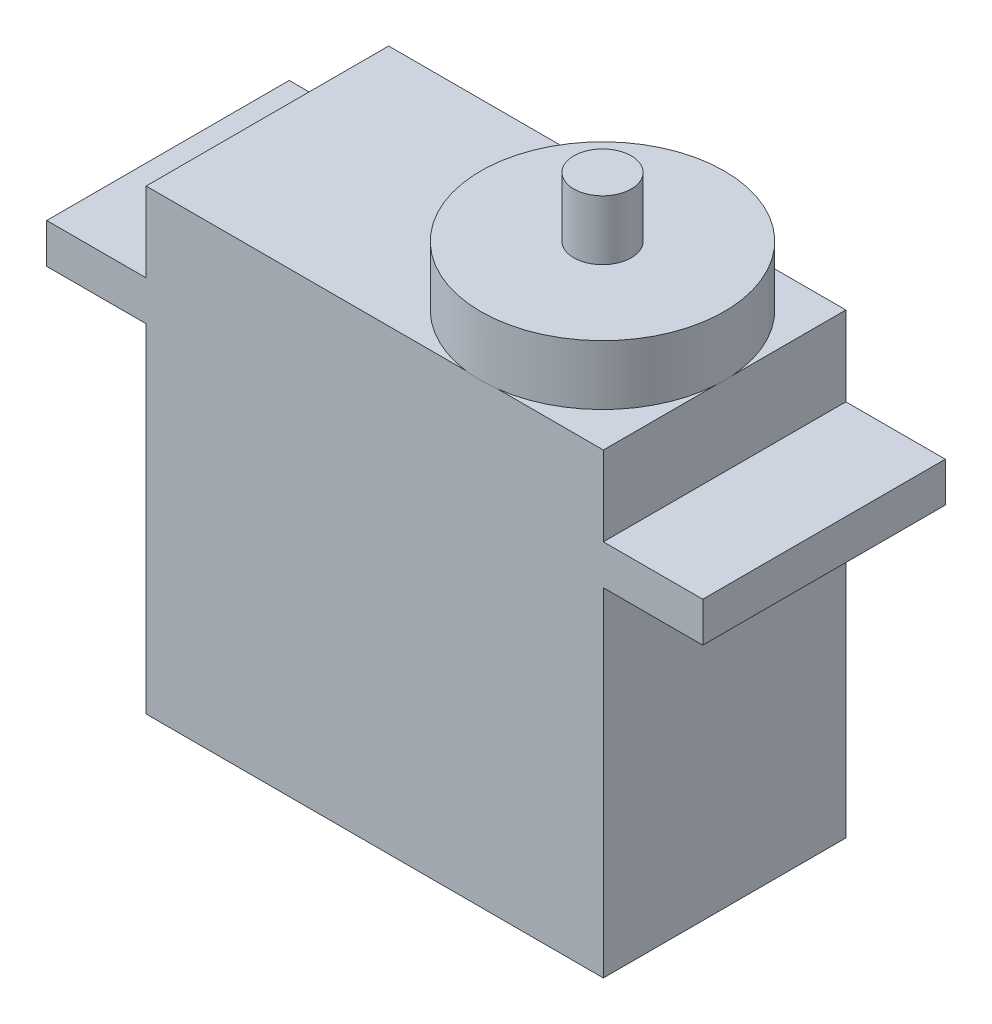
ISO-10303-21;
HEADER;
FILE_DESCRIPTION(('STEP AP214'),'2;1');
FILE_NAME('part.step','',(''),(''),'','','');
FILE_SCHEMA(('AUTOMOTIVE_DESIGN { 1 0 10303 214 1 1 1 1 }'));
ENDSEC;
DATA;
#1=APPLICATION_CONTEXT('core data for automotive mechanical design processes');
#2=APPLICATION_PROTOCOL_DEFINITION('international standard','automotive_design',2000,#1);
#3=PRODUCT_CONTEXT('',#1,'mechanical');
#4=PRODUCT('Part','Part','',(#3));
#5=PRODUCT_RELATED_PRODUCT_CATEGORY('part','',(#4));
#6=PRODUCT_DEFINITION_FORMATION('','',#4);
#7=PRODUCT_DEFINITION_CONTEXT('part definition',#1,'design');
#8=PRODUCT_DEFINITION('design','',#6,#7);
#9=PRODUCT_DEFINITION_SHAPE('','',#8);
#10=(LENGTH_UNIT() NAMED_UNIT(*) SI_UNIT(.MILLI.,.METRE.));
#11=(NAMED_UNIT(*) PLANE_ANGLE_UNIT() SI_UNIT($,.RADIAN.));
#12=(NAMED_UNIT(*) SI_UNIT($,.STERADIAN.) SOLID_ANGLE_UNIT());
#13=UNCERTAINTY_MEASURE_WITH_UNIT(LENGTH_MEASURE(1.E-05),#10,'distance_accuracy_value','');
#14=(GEOMETRIC_REPRESENTATION_CONTEXT(3) GLOBAL_UNCERTAINTY_ASSIGNED_CONTEXT((#13)) GLOBAL_UNIT_ASSIGNED_CONTEXT((#10,
#11,#12)) REPRESENTATION_CONTEXT('',''));
#15=CARTESIAN_POINT('',(0.,0.,0.));
#16=DIRECTION('',(0.,0.,1.));
#17=DIRECTION('',(1.,0.,0.));
#18=AXIS2_PLACEMENT_3D('',#15,#16,#17);
#19=CARTESIAN_POINT('',(0.,23.,12.2));
#20=DIRECTION('',(0.,-1.,0.));
#21=DIRECTION('',(0.,0.,-1.));
#22=AXIS2_PLACEMENT_3D('',#19,#20,#21);
#23=PLANE('',#22);
#24=CARTESIAN_POINT('',(16.8845324982303,23.,6.12639476714811));
#25=DIRECTION('',(0.,1.,0.));
#26=DIRECTION('',(0.,0.,1.));
#27=AXIS2_PLACEMENT_3D('',#24,#25,#26);
#28=CIRCLE('',#27,6.12668299708429);
#29=CARTESIAN_POINT('',(17.6892461257002,23.,12.2));
#30=VERTEX_POINT('',#29);
#31=CARTESIAN_POINT('',(23.,23.,6.49693731741728));
#32=VERTEX_POINT('',#31);
#33=EDGE_CURVE('E181',#30,#32,#28,.T.);
#34=ORIENTED_EDGE('',*,*,#33,.F.);
#35=DIRECTION('',(-1.,0.,0.));
#36=VECTOR('',#35,1.);
#37=CARTESIAN_POINT('',(0.,23.,12.2));
#38=LINE('',#37,#36);
#39=CARTESIAN_POINT('',(23.,23.,12.2));
#40=VERTEX_POINT('',#39);
#41=EDGE_CURVE('E161',#40,#30,#38,.T.);
#42=ORIENTED_EDGE('',*,*,#41,.F.);
#43=DIRECTION('',(0.,0.,-1.));
#44=VECTOR('',#43,1.);
#45=CARTESIAN_POINT('',(23.,23.,12.2));
#46=LINE('',#45,#44);
#47=EDGE_CURVE('E265',#40,#32,#46,.T.);
#48=ORIENTED_EDGE('',*,*,#47,.T.);
#49=EDGE_LOOP('',(#34,#42,#48));
#50=FACE_BOUND('',#49,.T.);
#51=ADVANCED_FACE('F43',(#50),#23,.F.);
#52=CARTESIAN_POINT('',(23.,23.,5.75585221687893));
#53=VERTEX_POINT('',#52);
#54=CARTESIAN_POINT('',(16.9439606382144,23.,0.));
#55=VERTEX_POINT('',#54);
#56=EDGE_CURVE('E53',#53,#55,#28,.T.);
#57=ORIENTED_EDGE('',*,*,#56,.F.);
#58=CARTESIAN_POINT('',(23.,23.,0.));
#59=VERTEX_POINT('',#58);
#60=EDGE_CURVE('E269',#53,#59,#46,.T.);
#61=ORIENTED_EDGE('',*,*,#60,.T.);
#62=DIRECTION('',(-1.,0.,0.));
#63=VECTOR('',#62,1.);
#64=CARTESIAN_POINT('',(0.,23.,0.));
#65=LINE('',#64,#63);
#66=EDGE_CURVE('E192',#59,#55,#65,.T.);
#67=ORIENTED_EDGE('',*,*,#66,.T.);
#68=EDGE_LOOP('',(#57,#61,#67));
#69=FACE_BOUND('',#68,.T.);
#70=ADVANCED_FACE('F235',(#69),#23,.F.);
#71=CARTESIAN_POINT('',(0.,0.,12.2));
#72=DIRECTION('',(1.,0.,0.));
#73=DIRECTION('',(0.,0.,-1.));
#74=AXIS2_PLACEMENT_3D('',#71,#72,#73);
#75=PLANE('',#74);
#76=DIRECTION('',(0.,-1.,0.));
#77=VECTOR('',#76,1.);
#78=CARTESIAN_POINT('',(0.,0.,0.));
#79=LINE('',#78,#77);
#80=CARTESIAN_POINT('',(0.,17.,0.));
#81=VERTEX_POINT('',#80);
#82=CARTESIAN_POINT('',(0.,0.,0.));
#83=VERTEX_POINT('',#82);
#84=EDGE_CURVE('E301',#81,#83,#79,.T.);
#85=ORIENTED_EDGE('',*,*,#84,.T.);
#86=DIRECTION('',(0.,0.,-1.));
#87=VECTOR('',#86,1.);
#88=CARTESIAN_POINT('',(0.,0.,12.2));
#89=LINE('',#88,#87);
#90=CARTESIAN_POINT('',(0.,0.,12.2));
#91=VERTEX_POINT('',#90);
#92=EDGE_CURVE('E186',#91,#83,#89,.T.);
#93=ORIENTED_EDGE('',*,*,#92,.F.);
#94=DIRECTION('',(0.,-1.,0.));
#95=VECTOR('',#94,1.);
#96=CARTESIAN_POINT('',(0.,0.,12.2));
#97=LINE('',#96,#95);
#98=CARTESIAN_POINT('',(0.,17.,12.2));
#99=VERTEX_POINT('',#98);
#100=EDGE_CURVE('E321',#99,#91,#97,.T.);
#101=ORIENTED_EDGE('',*,*,#100,.F.);
#102=DIRECTION('',(0.,0.,-1.));
#103=VECTOR('',#102,1.);
#104=CARTESIAN_POINT('',(0.,17.,12.2));
#105=LINE('',#104,#103);
#106=EDGE_CURVE('E322',#99,#81,#105,.T.);
#107=ORIENTED_EDGE('',*,*,#106,.T.);
#108=EDGE_LOOP('',(#85,#93,#101,#107));
#109=FACE_BOUND('',#108,.T.);
#110=ADVANCED_FACE('F45',(#109),#75,.F.);
#111=CARTESIAN_POINT('',(0.,0.,12.2));
#112=DIRECTION('',(0.,1.,0.));
#113=DIRECTION('',(0.,0.,1.));
#114=AXIS2_PLACEMENT_3D('',#111,#112,#113);
#115=PLANE('',#114);
#116=DIRECTION('',(1.,0.,0.));
#117=VECTOR('',#116,1.);
#118=CARTESIAN_POINT('',(0.,0.,0.));
#119=LINE('',#118,#117);
#120=CARTESIAN_POINT('',(23.,0.,0.));
#121=VERTEX_POINT('',#120);
#122=EDGE_CURVE('E295',#83,#121,#119,.T.);
#123=ORIENTED_EDGE('',*,*,#122,.T.);
#124=DIRECTION('',(0.,0.,-1.));
#125=VECTOR('',#124,1.);
#126=CARTESIAN_POINT('',(23.,0.,12.2));
#127=LINE('',#126,#125);
#128=CARTESIAN_POINT('',(23.,0.,12.2));
#129=VERTEX_POINT('',#128);
#130=EDGE_CURVE('E189',#129,#121,#127,.T.);
#131=ORIENTED_EDGE('',*,*,#130,.F.);
#132=DIRECTION('',(1.,0.,0.));
#133=VECTOR('',#132,1.);
#134=CARTESIAN_POINT('',(0.,0.,12.2));
#135=LINE('',#134,#133);
#136=EDGE_CURVE('E375',#91,#129,#135,.T.);
#137=ORIENTED_EDGE('',*,*,#136,.F.);
#138=ORIENTED_EDGE('',*,*,#92,.T.);
#139=EDGE_LOOP('',(#123,#131,#137,#138));
#140=FACE_BOUND('',#139,.T.);
#141=ADVANCED_FACE('F252',(#140),#115,.F.);
#142=CARTESIAN_POINT('',(23.,0.,12.2));
#143=DIRECTION('',(-1.,0.,0.));
#144=DIRECTION('',(0.,0.,1.));
#145=AXIS2_PLACEMENT_3D('',#142,#143,#144);
#146=PLANE('',#145);
#147=DIRECTION('',(0.,1.,0.));
#148=VECTOR('',#147,1.);
#149=CARTESIAN_POINT('',(23.,0.,0.));
#150=LINE('',#149,#148);
#151=CARTESIAN_POINT('',(23.,17.,0.));
#152=VERTEX_POINT('',#151);
#153=EDGE_CURVE('E291',#121,#152,#150,.T.);
#154=ORIENTED_EDGE('',*,*,#153,.T.);
#155=DIRECTION('',(0.,0.,-1.));
#156=VECTOR('',#155,1.);
#157=CARTESIAN_POINT('',(23.,17.,12.2));
#158=LINE('',#157,#156);
#159=CARTESIAN_POINT('',(23.,17.,12.2));
#160=VERTEX_POINT('',#159);
#161=EDGE_CURVE('E283',#160,#152,#158,.T.);
#162=ORIENTED_EDGE('',*,*,#161,.F.);
#163=DIRECTION('',(0.,1.,0.));
#164=VECTOR('',#163,1.);
#165=CARTESIAN_POINT('',(23.,0.,12.2));
#166=LINE('',#165,#164);
#167=EDGE_CURVE('E292',#129,#160,#166,.T.);
#168=ORIENTED_EDGE('',*,*,#167,.F.);
#169=ORIENTED_EDGE('',*,*,#130,.T.);
#170=EDGE_LOOP('',(#154,#162,#168,#169));
#171=FACE_BOUND('',#170,.T.);
#172=ADVANCED_FACE('F249',(#171),#146,.F.);
#173=CARTESIAN_POINT('',(28.,17.,12.2));
#174=DIRECTION('',(0.,1.,0.));
#175=DIRECTION('',(0.,0.,1.));
#176=AXIS2_PLACEMENT_3D('',#173,#174,#175);
#177=PLANE('',#176);
#178=DIRECTION('',(1.,0.,0.));
#179=VECTOR('',#178,1.);
#180=CARTESIAN_POINT('',(28.,17.,0.));
#181=LINE('',#180,#179);
#182=CARTESIAN_POINT('',(28.,17.,0.));
#183=VERTEX_POINT('',#182);
#184=EDGE_CURVE('E297',#152,#183,#181,.T.);
#185=ORIENTED_EDGE('',*,*,#184,.T.);
#186=DIRECTION('',(0.,0.,-1.));
#187=VECTOR('',#186,1.);
#188=CARTESIAN_POINT('',(28.,17.,12.2));
#189=LINE('',#188,#187);
#190=CARTESIAN_POINT('',(28.,17.,12.2));
#191=VERTEX_POINT('',#190);
#192=EDGE_CURVE('E280',#191,#183,#189,.T.);
#193=ORIENTED_EDGE('',*,*,#192,.F.);
#194=DIRECTION('',(1.,0.,0.));
#195=VECTOR('',#194,1.);
#196=CARTESIAN_POINT('',(28.,17.,12.2));
#197=LINE('',#196,#195);
#198=EDGE_CURVE('E378',#160,#191,#197,.T.);
#199=ORIENTED_EDGE('',*,*,#198,.F.);
#200=ORIENTED_EDGE('',*,*,#161,.T.);
#201=EDGE_LOOP('',(#185,#193,#199,#200));
#202=FACE_BOUND('',#201,.T.);
#203=ADVANCED_FACE('F245',(#202),#177,.F.);
#204=CARTESIAN_POINT('',(28.,19.,12.2));
#205=DIRECTION('',(-1.,0.,0.));
#206=DIRECTION('',(0.,0.,1.));
#207=AXIS2_PLACEMENT_3D('',#204,#205,#206);
#208=PLANE('',#207);
#209=DIRECTION('',(0.,1.,0.));
#210=VECTOR('',#209,1.);
#211=CARTESIAN_POINT('',(28.,19.,0.));
#212=LINE('',#211,#210);
#213=CARTESIAN_POINT('',(28.,19.,0.));
#214=VERTEX_POINT('',#213);
#215=EDGE_CURVE('E299',#183,#214,#212,.T.);
#216=ORIENTED_EDGE('',*,*,#215,.T.);
#217=DIRECTION('',(0.,0.,-1.));
#218=VECTOR('',#217,1.);
#219=CARTESIAN_POINT('',(28.,19.,12.2));
#220=LINE('',#219,#218);
#221=CARTESIAN_POINT('',(28.,19.,12.2));
#222=VERTEX_POINT('',#221);
#223=EDGE_CURVE('E277',#222,#214,#220,.T.);
#224=ORIENTED_EDGE('',*,*,#223,.F.);
#225=DIRECTION('',(0.,1.,0.));
#226=VECTOR('',#225,1.);
#227=CARTESIAN_POINT('',(28.,19.,12.2));
#228=LINE('',#227,#226);
#229=EDGE_CURVE('E380',#191,#222,#228,.T.);
#230=ORIENTED_EDGE('',*,*,#229,.F.);
#231=ORIENTED_EDGE('',*,*,#192,.T.);
#232=EDGE_LOOP('',(#216,#224,#230,#231));
#233=FACE_BOUND('',#232,.T.);
#234=ADVANCED_FACE('F241',(#233),#208,.F.);
#235=CARTESIAN_POINT('',(23.,19.,12.2));
#236=DIRECTION('',(0.,-1.,0.));
#237=DIRECTION('',(0.,0.,-1.));
#238=AXIS2_PLACEMENT_3D('',#235,#236,#237);
#239=PLANE('',#238);
#240=DIRECTION('',(-1.,0.,0.));
#241=VECTOR('',#240,1.);
#242=CARTESIAN_POINT('',(23.,19.,0.));
#243=LINE('',#242,#241);
#244=CARTESIAN_POINT('',(23.,19.,0.));
#245=VERTEX_POINT('',#244);
#246=EDGE_CURVE('E306',#214,#245,#243,.T.);
#247=ORIENTED_EDGE('',*,*,#246,.T.);
#248=DIRECTION('',(0.,0.,-1.));
#249=VECTOR('',#248,1.);
#250=CARTESIAN_POINT('',(23.,19.,12.2));
#251=LINE('',#250,#249);
#252=CARTESIAN_POINT('',(23.,19.,12.2));
#253=VERTEX_POINT('',#252);
#254=EDGE_CURVE('E271',#253,#245,#251,.T.);
#255=ORIENTED_EDGE('',*,*,#254,.F.);
#256=DIRECTION('',(-1.,0.,0.));
#257=VECTOR('',#256,1.);
#258=CARTESIAN_POINT('',(23.,19.,12.2));
#259=LINE('',#258,#257);
#260=EDGE_CURVE('E382',#222,#253,#259,.T.);
#261=ORIENTED_EDGE('',*,*,#260,.F.);
#262=ORIENTED_EDGE('',*,*,#223,.T.);
#263=EDGE_LOOP('',(#247,#255,#261,#262));
#264=FACE_BOUND('',#263,.T.);
#265=ADVANCED_FACE('F238',(#264),#239,.F.);
#266=CARTESIAN_POINT('',(23.,19.,12.2));
#267=DIRECTION('',(-1.,0.,0.));
#268=DIRECTION('',(0.,0.,1.));
#269=AXIS2_PLACEMENT_3D('',#266,#267,#268);
#270=PLANE('',#269);
#271=DIRECTION('',(0.,1.,0.));
#272=VECTOR('',#271,1.);
#273=CARTESIAN_POINT('',(23.,19.,0.));
#274=LINE('',#273,#272);
#275=EDGE_CURVE('E308',#245,#59,#274,.T.);
#276=ORIENTED_EDGE('',*,*,#275,.T.);
#277=ORIENTED_EDGE('',*,*,#60,.F.);
#278=EDGE_CURVE('E67',#32,#53,#46,.T.);
#279=ORIENTED_EDGE('',*,*,#278,.F.);
#280=ORIENTED_EDGE('',*,*,#47,.F.);
#281=DIRECTION('',(0.,1.,0.));
#282=VECTOR('',#281,1.);
#283=CARTESIAN_POINT('',(23.,19.,12.2));
#284=LINE('',#283,#282);
#285=EDGE_CURVE('E173',#253,#40,#284,.T.);
#286=ORIENTED_EDGE('',*,*,#285,.F.);
#287=ORIENTED_EDGE('',*,*,#254,.T.);
#288=EDGE_LOOP('',(#276,#277,#279,#280,#286,#287));
#289=FACE_BOUND('',#288,.T.);
#290=ADVANCED_FACE('F234',(#289),#270,.F.);
#291=CARTESIAN_POINT('',(16.8251043582462,23.,0.));
#292=VERTEX_POINT('',#291);
#293=CARTESIAN_POINT('',(16.0798188707603,23.,12.2));
#294=VERTEX_POINT('',#293);
#295=EDGE_CURVE('E168',#292,#294,#28,.T.);
#296=ORIENTED_EDGE('',*,*,#295,.F.);
#297=CARTESIAN_POINT('',(0.,23.,0.));
#298=VERTEX_POINT('',#297);
#299=EDGE_CURVE('E47',#292,#298,#65,.T.);
#300=ORIENTED_EDGE('',*,*,#299,.T.);
#301=DIRECTION('',(0.,0.,-1.));
#302=VECTOR('',#301,1.);
#303=CARTESIAN_POINT('',(0.,23.,12.2));
#304=LINE('',#303,#302);
#305=CARTESIAN_POINT('',(0.,23.,12.2));
#306=VERTEX_POINT('',#305);
#307=EDGE_CURVE('E171',#306,#298,#304,.T.);
#308=ORIENTED_EDGE('',*,*,#307,.F.);
#309=EDGE_CURVE('E158',#294,#306,#38,.T.);
#310=ORIENTED_EDGE('',*,*,#309,.F.);
#311=EDGE_LOOP('',(#296,#300,#308,#310));
#312=FACE_BOUND('',#311,.T.);
#313=ADVANCED_FACE('F166',(#312),#23,.F.);
#314=CARTESIAN_POINT('',(0.,19.,12.2));
#315=DIRECTION('',(1.,0.,0.));
#316=DIRECTION('',(0.,0.,-1.));
#317=AXIS2_PLACEMENT_3D('',#314,#315,#316);
#318=PLANE('',#317);
#319=DIRECTION('',(0.,-1.,0.));
#320=VECTOR('',#319,1.);
#321=CARTESIAN_POINT('',(0.,19.,0.));
#322=LINE('',#321,#320);
#323=CARTESIAN_POINT('',(0.,19.,0.));
#324=VERTEX_POINT('',#323);
#325=EDGE_CURVE('E312',#298,#324,#322,.T.);
#326=ORIENTED_EDGE('',*,*,#325,.T.);
#327=DIRECTION('',(0.,0.,-1.));
#328=VECTOR('',#327,1.);
#329=CARTESIAN_POINT('',(0.,19.,12.2));
#330=LINE('',#329,#328);
#331=CARTESIAN_POINT('',(0.,19.,12.2));
#332=VERTEX_POINT('',#331);
#333=EDGE_CURVE('E331',#332,#324,#330,.T.);
#334=ORIENTED_EDGE('',*,*,#333,.F.);
#335=DIRECTION('',(0.,-1.,0.));
#336=VECTOR('',#335,1.);
#337=CARTESIAN_POINT('',(0.,19.,12.2));
#338=LINE('',#337,#336);
#339=EDGE_CURVE('E337',#306,#332,#338,.T.);
#340=ORIENTED_EDGE('',*,*,#339,.F.);
#341=ORIENTED_EDGE('',*,*,#307,.T.);
#342=EDGE_LOOP('',(#326,#334,#340,#341));
#343=FACE_BOUND('',#342,.T.);
#344=ADVANCED_FACE('F227',(#343),#318,.F.);
#345=CARTESIAN_POINT('',(0.,19.,12.2));
#346=DIRECTION('',(0.,-1.,0.));
#347=DIRECTION('',(0.,0.,-1.));
#348=AXIS2_PLACEMENT_3D('',#345,#346,#347);
#349=PLANE('',#348);
#350=DIRECTION('',(-1.,0.,0.));
#351=VECTOR('',#350,1.);
#352=CARTESIAN_POINT('',(0.,19.,0.));
#353=LINE('',#352,#351);
#354=CARTESIAN_POINT('',(-5.,19.,0.));
#355=VERTEX_POINT('',#354);
#356=EDGE_CURVE('E315',#324,#355,#353,.T.);
#357=ORIENTED_EDGE('',*,*,#356,.T.);
#358=DIRECTION('',(0.,0.,-1.));
#359=VECTOR('',#358,1.);
#360=CARTESIAN_POINT('',(-5.,19.,12.2));
#361=LINE('',#360,#359);
#362=CARTESIAN_POINT('',(-5.,19.,12.2));
#363=VERTEX_POINT('',#362);
#364=EDGE_CURVE('E329',#363,#355,#361,.T.);
#365=ORIENTED_EDGE('',*,*,#364,.F.);
#366=DIRECTION('',(-1.,0.,0.));
#367=VECTOR('',#366,1.);
#368=CARTESIAN_POINT('',(0.,19.,12.2));
#369=LINE('',#368,#367);
#370=EDGE_CURVE('E345',#332,#363,#369,.T.);
#371=ORIENTED_EDGE('',*,*,#370,.F.);
#372=ORIENTED_EDGE('',*,*,#333,.T.);
#373=EDGE_LOOP('',(#357,#365,#371,#372));
#374=FACE_BOUND('',#373,.T.);
#375=ADVANCED_FACE('F223',(#374),#349,.F.);
#376=CARTESIAN_POINT('',(-5.,19.,12.2));
#377=DIRECTION('',(1.,0.,0.));
#378=DIRECTION('',(0.,0.,-1.));
#379=AXIS2_PLACEMENT_3D('',#376,#377,#378);
#380=PLANE('',#379);
#381=DIRECTION('',(0.,-1.,0.));
#382=VECTOR('',#381,1.);
#383=CARTESIAN_POINT('',(-5.,19.,0.));
#384=LINE('',#383,#382);
#385=CARTESIAN_POINT('',(-5.,17.,0.));
#386=VERTEX_POINT('',#385);
#387=EDGE_CURVE('E317',#355,#386,#384,.T.);
#388=ORIENTED_EDGE('',*,*,#387,.T.);
#389=DIRECTION('',(0.,0.,-1.));
#390=VECTOR('',#389,1.);
#391=CARTESIAN_POINT('',(-5.,17.,12.2));
#392=LINE('',#391,#390);
#393=CARTESIAN_POINT('',(-5.,17.,12.2));
#394=VERTEX_POINT('',#393);
#395=EDGE_CURVE('E325',#394,#386,#392,.T.);
#396=ORIENTED_EDGE('',*,*,#395,.F.);
#397=DIRECTION('',(0.,-1.,0.));
#398=VECTOR('',#397,1.);
#399=CARTESIAN_POINT('',(-5.,19.,12.2));
#400=LINE('',#399,#398);
#401=EDGE_CURVE('E343',#363,#394,#400,.T.);
#402=ORIENTED_EDGE('',*,*,#401,.F.);
#403=ORIENTED_EDGE('',*,*,#364,.T.);
#404=EDGE_LOOP('',(#388,#396,#402,#403));
#405=FACE_BOUND('',#404,.T.);
#406=ADVANCED_FACE('F219',(#405),#380,.F.);
#407=CARTESIAN_POINT('',(-5.,17.,12.2));
#408=DIRECTION('',(0.,1.,0.));
#409=DIRECTION('',(0.,0.,1.));
#410=AXIS2_PLACEMENT_3D('',#407,#408,#409);
#411=PLANE('',#410);
#412=DIRECTION('',(1.,0.,0.));
#413=VECTOR('',#412,1.);
#414=CARTESIAN_POINT('',(-5.,17.,0.));
#415=LINE('',#414,#413);
#416=EDGE_CURVE('E319',#386,#81,#415,.T.);
#417=ORIENTED_EDGE('',*,*,#416,.T.);
#418=ORIENTED_EDGE('',*,*,#106,.F.);
#419=DIRECTION('',(1.,0.,0.));
#420=VECTOR('',#419,1.);
#421=CARTESIAN_POINT('',(-5.,17.,12.2));
#422=LINE('',#421,#420);
#423=EDGE_CURVE('E326',#394,#99,#422,.T.);
#424=ORIENTED_EDGE('',*,*,#423,.F.);
#425=ORIENTED_EDGE('',*,*,#395,.T.);
#426=EDGE_LOOP('',(#417,#418,#424,#425));
#427=FACE_BOUND('',#426,.T.);
#428=ADVANCED_FACE('F216',(#427),#411,.F.);
#429=CARTESIAN_POINT('',(0.,0.,12.2));
#430=DIRECTION('',(0.,0.,-1.));
#431=DIRECTION('',(-1.,0.,0.));
#432=AXIS2_PLACEMENT_3D('',#429,#430,#431);
#433=PLANE('',#432);
#434=ORIENTED_EDGE('',*,*,#100,.T.);
#435=ORIENTED_EDGE('',*,*,#136,.T.);
#436=ORIENTED_EDGE('',*,*,#167,.T.);
#437=ORIENTED_EDGE('',*,*,#198,.T.);
#438=ORIENTED_EDGE('',*,*,#229,.T.);
#439=ORIENTED_EDGE('',*,*,#260,.T.);
#440=ORIENTED_EDGE('',*,*,#285,.T.);
#441=ORIENTED_EDGE('',*,*,#41,.T.);
#442=EDGE_CURVE('E154',#30,#294,#38,.T.);
#443=ORIENTED_EDGE('',*,*,#442,.T.);
#444=ORIENTED_EDGE('',*,*,#309,.T.);
#445=ORIENTED_EDGE('',*,*,#339,.T.);
#446=ORIENTED_EDGE('',*,*,#370,.T.);
#447=ORIENTED_EDGE('',*,*,#401,.T.);
#448=ORIENTED_EDGE('',*,*,#423,.T.);
#449=EDGE_LOOP('',(#434,#435,#436,#437,#438,#439,#440,#441,#443,#444,#445,#446,#447,#448));
#450=FACE_BOUND('',#449,.T.);
#451=ADVANCED_FACE('F157',(#450),#433,.F.);
#452=CARTESIAN_POINT('',(0.,0.,0.));
#453=DIRECTION('',(0.,0.,-1.));
#454=DIRECTION('',(-1.,0.,0.));
#455=AXIS2_PLACEMENT_3D('',#452,#453,#454);
#456=PLANE('',#455);
#457=ORIENTED_EDGE('',*,*,#84,.F.);
#458=ORIENTED_EDGE('',*,*,#416,.F.);
#459=ORIENTED_EDGE('',*,*,#387,.F.);
#460=ORIENTED_EDGE('',*,*,#356,.F.);
#461=ORIENTED_EDGE('',*,*,#325,.F.);
#462=ORIENTED_EDGE('',*,*,#299,.F.);
#463=CARTESIAN_POINT('',(16.8845324982303,23.,6.12639476714811));
#464=DIRECTION('',(0.,1.,0.));
#465=DIRECTION('',(0.00969988817968429,0.,-0.999952954978034));
#466=AXIS2_PLACEMENT_3D('',#463,#464,#465);
#467=CIRCLE('',#466,6.12668299708429);
#468=EDGE_CURVE('E184',#55,#292,#467,.T.);
#469=ORIENTED_EDGE('',*,*,#468,.F.);
#470=ORIENTED_EDGE('',*,*,#66,.F.);
#471=ORIENTED_EDGE('',*,*,#275,.F.);
#472=ORIENTED_EDGE('',*,*,#246,.F.);
#473=ORIENTED_EDGE('',*,*,#215,.F.);
#474=ORIENTED_EDGE('',*,*,#184,.F.);
#475=ORIENTED_EDGE('',*,*,#153,.F.);
#476=ORIENTED_EDGE('',*,*,#122,.F.);
#477=EDGE_LOOP('',(#457,#458,#459,#460,#461,#462,#469,#470,#471,#472,#473,#474,#475,#476));
#478=FACE_BOUND('',#477,.T.);
#479=ADVANCED_FACE('F203',(#478),#456,.T.);
#480=CARTESIAN_POINT('',(16.8845324982303,23.,6.12639476714811));
#481=DIRECTION('',(0.,1.,0.));
#482=DIRECTION('',(0.,0.,1.));
#483=AXIS2_PLACEMENT_3D('',#480,#481,#482);
#484=PLANE('',#483);
#485=EDGE_CURVE('E178',#32,#53,#28,.T.);
#486=ORIENTED_EDGE('',*,*,#485,.F.);
#487=ORIENTED_EDGE('',*,*,#278,.T.);
#488=EDGE_LOOP('',(#486,#487));
#489=FACE_BOUND('',#488,.T.);
#490=ADVANCED_FACE('F213',(#489),#484,.F.);
#491=CARTESIAN_POINT('',(16.8845324982303,26.,6.12639476714811));
#492=DIRECTION('',(0.,-1.,0.));
#493=DIRECTION('',(0.,0.,-1.));
#494=AXIS2_PLACEMENT_3D('',#491,#492,#493);
#495=CYLINDRICAL_SURFACE('',#494,6.12668299708429);
#496=CARTESIAN_POINT('',(16.8845324982303,26.,6.12639476714811));
#497=DIRECTION('',(0.,1.,0.));
#498=DIRECTION('',(0.,0.,1.));
#499=AXIS2_PLACEMENT_3D('',#496,#497,#498);
#500=CIRCLE('',#499,6.12668299708429);
#501=CARTESIAN_POINT('',(16.8845324982303,26.,12.2530777642324));
#502=VERTEX_POINT('',#501);
#503=EDGE_CURVE('E195',#502,#502,#500,.T.);
#504=ORIENTED_EDGE('',*,*,#503,.F.);
#505=EDGE_LOOP('',(#504));
#506=FACE_BOUND('',#505,.T.);
#507=ORIENTED_EDGE('',*,*,#33,.T.);
#508=ORIENTED_EDGE('',*,*,#485,.T.);
#509=ORIENTED_EDGE('',*,*,#56,.T.);
#510=ORIENTED_EDGE('',*,*,#468,.T.);
#511=ORIENTED_EDGE('',*,*,#295,.T.);
#512=EDGE_CURVE('E174',#294,#30,#28,.T.);
#513=ORIENTED_EDGE('',*,*,#512,.T.);
#514=EDGE_LOOP('',(#507,#508,#509,#510,#511,#513));
#515=FACE_BOUND('',#514,.T.);
#516=ADVANCED_FACE('F183',(#506,#515),#495,.T.);
#517=CARTESIAN_POINT('',(16.8845324982303,26.,6.12639476714811));
#518=DIRECTION('',(0.,1.,0.));
#519=DIRECTION('',(0.,0.,1.));
#520=AXIS2_PLACEMENT_3D('',#517,#518,#519);
#521=PLANE('',#520);
#522=CARTESIAN_POINT('',(16.8845324982303,26.,6.12639476714811));
#523=DIRECTION('',(0.,1.,0.));
#524=DIRECTION('',(0.,0.,1.));
#525=AXIS2_PLACEMENT_3D('',#522,#523,#524);
#526=CIRCLE('',#525,1.445);
#527=CARTESIAN_POINT('',(16.8845324982303,26.,7.57139476714811));
#528=VERTEX_POINT('',#527);
#529=EDGE_CURVE('E12',#528,#528,#526,.T.);
#530=ORIENTED_EDGE('',*,*,#529,.F.);
#531=EDGE_LOOP('',(#530));
#532=FACE_BOUND('',#531,.T.);
#533=ORIENTED_EDGE('',*,*,#503,.T.);
#534=EDGE_LOOP('',(#533));
#535=FACE_BOUND('',#534,.T.);
#536=ADVANCED_FACE('F355',(#532,#535),#521,.T.);
#537=ORIENTED_EDGE('',*,*,#442,.F.);
#538=ORIENTED_EDGE('',*,*,#512,.F.);
#539=EDGE_LOOP('',(#537,#538));
#540=FACE_BOUND('',#539,.T.);
#541=ADVANCED_FACE('F175',(#540),#484,.F.);
#542=CARTESIAN_POINT('',(16.8845324982303,29.,6.12639476714811));
#543=DIRECTION('',(0.,-1.,0.));
#544=DIRECTION('',(0.,0.,-1.));
#545=AXIS2_PLACEMENT_3D('',#542,#543,#544);
#546=CYLINDRICAL_SURFACE('',#545,1.445);
#547=CARTESIAN_POINT('',(16.8845324982303,29.,6.12639476714811));
#548=DIRECTION('',(0.,1.,0.));
#549=DIRECTION('',(0.,0.,1.));
#550=AXIS2_PLACEMENT_3D('',#547,#548,#549);
#551=CIRCLE('',#550,1.445);
#552=CARTESIAN_POINT('',(16.8845324982303,29.,7.57139476714811));
#553=VERTEX_POINT('',#552);
#554=EDGE_CURVE('E179',#553,#553,#551,.T.);
#555=ORIENTED_EDGE('',*,*,#554,.F.);
#556=EDGE_LOOP('',(#555));
#557=FACE_BOUND('',#556,.T.);
#558=ORIENTED_EDGE('',*,*,#529,.T.);
#559=EDGE_LOOP('',(#558));
#560=FACE_BOUND('',#559,.T.);
#561=ADVANCED_FACE('F399',(#557,#560),#546,.T.);
#562=CARTESIAN_POINT('',(16.8845324982303,29.,6.12639476714811));
#563=DIRECTION('',(0.,1.,0.));
#564=DIRECTION('',(0.,0.,1.));
#565=AXIS2_PLACEMENT_3D('',#562,#563,#564);
#566=PLANE('',#565);
#567=ORIENTED_EDGE('',*,*,#554,.T.);
#568=EDGE_LOOP('',(#567));
#569=FACE_BOUND('',#568,.T.);
#570=ADVANCED_FACE('F403',(#569),#566,.T.);
#571=CLOSED_SHELL('',(#51,#70,#110,#141,#172,#203,#234,#265,#290,#313,#344,#375,#406,#428,#451,
#479,#490,#516,#536,#541,#561,#570));
#572=MANIFOLD_SOLID_BREP('B2',#571);
#573=ADVANCED_BREP_SHAPE_REPRESENTATION('',(#18,#572),#14);
#574=SHAPE_DEFINITION_REPRESENTATION(#9,#573);
ENDSEC;
END-ISO-10303-21;
